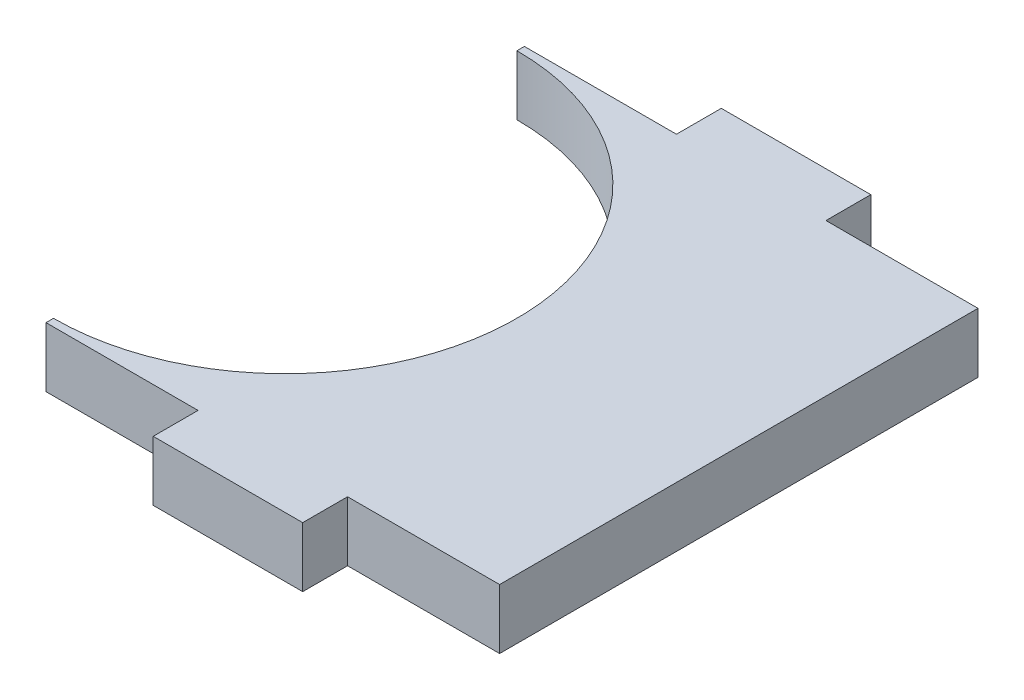
ISO-10303-21;
HEADER;
FILE_DESCRIPTION(('STEP AP214'),'2;1');
FILE_NAME('part.step','',(''),(''),'','','');
FILE_SCHEMA(('AUTOMOTIVE_DESIGN { 1 0 10303 214 1 1 1 1 }'));
ENDSEC;
DATA;
#1=APPLICATION_CONTEXT('core data for automotive mechanical design processes');
#2=APPLICATION_PROTOCOL_DEFINITION('international standard','automotive_design',2000,#1);
#3=PRODUCT_CONTEXT('',#1,'mechanical');
#4=PRODUCT('Part','Part','',(#3));
#5=PRODUCT_RELATED_PRODUCT_CATEGORY('part','',(#4));
#6=PRODUCT_DEFINITION_FORMATION('','',#4);
#7=PRODUCT_DEFINITION_CONTEXT('part definition',#1,'design');
#8=PRODUCT_DEFINITION('design','',#6,#7);
#9=PRODUCT_DEFINITION_SHAPE('','',#8);
#10=(LENGTH_UNIT() NAMED_UNIT(*) SI_UNIT(.MILLI.,.METRE.));
#11=(NAMED_UNIT(*) PLANE_ANGLE_UNIT() SI_UNIT($,.RADIAN.));
#12=(NAMED_UNIT(*) SI_UNIT($,.STERADIAN.) SOLID_ANGLE_UNIT());
#13=UNCERTAINTY_MEASURE_WITH_UNIT(LENGTH_MEASURE(1.E-05),#10,'distance_accuracy_value','');
#14=(GEOMETRIC_REPRESENTATION_CONTEXT(3) GLOBAL_UNCERTAINTY_ASSIGNED_CONTEXT((#13)) GLOBAL_UNIT_ASSIGNED_CONTEXT((#10,
#11,#12)) REPRESENTATION_CONTEXT('',''));
#15=CARTESIAN_POINT('',(0.,0.,0.));
#16=DIRECTION('',(0.,0.,1.));
#17=DIRECTION('',(1.,0.,0.));
#18=AXIS2_PLACEMENT_3D('',#15,#16,#17);
#19=CARTESIAN_POINT('',(59.828997207122,0.499999999999999,36.));
#20=DIRECTION('',(0.,0.,1.));
#21=DIRECTION('',(1.,0.,0.));
#22=AXIS2_PLACEMENT_3D('',#19,#20,#21);
#23=PLANE('',#22);
#24=DIRECTION('',(1.,0.,0.));
#25=VECTOR('',#24,1.);
#26=CARTESIAN_POINT('',(59.828997207122,4.5,36.));
#27=LINE('',#26,#25);
#28=CARTESIAN_POINT('',(59.828997207122,4.5,36.));
#29=VERTEX_POINT('',#28);
#30=CARTESIAN_POINT('',(70.,4.5,36.));
#31=VERTEX_POINT('',#30);
#32=EDGE_CURVE('E185',#29,#31,#27,.T.);
#33=ORIENTED_EDGE('',*,*,#32,.F.);
#34=DIRECTION('',(0.,1.,0.));
#35=VECTOR('',#34,1.);
#36=CARTESIAN_POINT('',(59.828997207122,0.499999999999999,36.));
#37=LINE('',#36,#35);
#38=CARTESIAN_POINT('',(59.828997207122,0.499999999999999,36.));
#39=VERTEX_POINT('',#38);
#40=EDGE_CURVE('E12',#39,#29,#37,.T.);
#41=ORIENTED_EDGE('',*,*,#40,.F.);
#42=DIRECTION('',(1.,0.,0.));
#43=VECTOR('',#42,1.);
#44=CARTESIAN_POINT('',(59.828997207122,0.499999999999999,36.));
#45=LINE('',#44,#43);
#46=CARTESIAN_POINT('',(70.,0.499999999999999,36.));
#47=VERTEX_POINT('',#46);
#48=EDGE_CURVE('E256',#39,#47,#45,.T.);
#49=ORIENTED_EDGE('',*,*,#48,.T.);
#50=DIRECTION('',(0.,1.,0.));
#51=VECTOR('',#50,1.);
#52=CARTESIAN_POINT('',(70.,0.499999999999999,36.));
#53=LINE('',#52,#51);
#54=EDGE_CURVE('E48',#47,#31,#53,.T.);
#55=ORIENTED_EDGE('',*,*,#54,.T.);
#56=EDGE_LOOP('',(#33,#41,#49,#55));
#57=FACE_BOUND('',#56,.T.);
#58=ADVANCED_FACE('F45',(#57),#23,.T.);
#59=CARTESIAN_POINT('',(59.828997207122,0.499999999999999,39.));
#60=DIRECTION('',(1.,0.,0.));
#61=DIRECTION('',(0.,0.,-1.));
#62=AXIS2_PLACEMENT_3D('',#59,#60,#61);
#63=PLANE('',#62);
#64=DIRECTION('',(0.,0.,-1.));
#65=VECTOR('',#64,1.);
#66=CARTESIAN_POINT('',(59.828997207122,4.5,39.));
#67=LINE('',#66,#65);
#68=CARTESIAN_POINT('',(59.828997207122,4.5,39.));
#69=VERTEX_POINT('',#68);
#70=EDGE_CURVE('E252',#69,#29,#67,.T.);
#71=ORIENTED_EDGE('',*,*,#70,.F.);
#72=DIRECTION('',(0.,1.,0.));
#73=VECTOR('',#72,1.);
#74=CARTESIAN_POINT('',(59.828997207122,0.499999999999999,39.));
#75=LINE('',#74,#73);
#76=CARTESIAN_POINT('',(59.828997207122,0.499999999999999,39.));
#77=VERTEX_POINT('',#76);
#78=EDGE_CURVE('E55',#77,#69,#75,.T.);
#79=ORIENTED_EDGE('',*,*,#78,.F.);
#80=DIRECTION('',(0.,0.,-1.));
#81=VECTOR('',#80,1.);
#82=CARTESIAN_POINT('',(59.828997207122,0.499999999999999,39.));
#83=LINE('',#82,#81);
#84=EDGE_CURVE('E170',#77,#39,#83,.T.);
#85=ORIENTED_EDGE('',*,*,#84,.T.);
#86=ORIENTED_EDGE('',*,*,#40,.T.);
#87=EDGE_LOOP('',(#71,#79,#85,#86));
#88=FACE_BOUND('',#87,.T.);
#89=ADVANCED_FACE('F296',(#88),#63,.T.);
#90=CARTESIAN_POINT('',(49.828997207122,0.499999999999999,39.));
#91=DIRECTION('',(0.,0.,1.));
#92=DIRECTION('',(1.,0.,0.));
#93=AXIS2_PLACEMENT_3D('',#90,#91,#92);
#94=PLANE('',#93);
#95=DIRECTION('',(1.,0.,0.));
#96=VECTOR('',#95,1.);
#97=CARTESIAN_POINT('',(49.828997207122,4.5,39.));
#98=LINE('',#97,#96);
#99=CARTESIAN_POINT('',(49.828997207122,4.5,39.));
#100=VERTEX_POINT('',#99);
#101=EDGE_CURVE('E156',#100,#69,#98,.T.);
#102=ORIENTED_EDGE('',*,*,#101,.F.);
#103=DIRECTION('',(0.,1.,0.));
#104=VECTOR('',#103,1.);
#105=CARTESIAN_POINT('',(49.828997207122,0.499999999999999,39.));
#106=LINE('',#105,#104);
#107=CARTESIAN_POINT('',(49.828997207122,0.499999999999999,39.));
#108=VERTEX_POINT('',#107);
#109=EDGE_CURVE('E151',#108,#100,#106,.T.);
#110=ORIENTED_EDGE('',*,*,#109,.F.);
#111=DIRECTION('',(1.,0.,0.));
#112=VECTOR('',#111,1.);
#113=CARTESIAN_POINT('',(49.828997207122,0.499999999999999,39.));
#114=LINE('',#113,#112);
#115=EDGE_CURVE('E154',#108,#77,#114,.T.);
#116=ORIENTED_EDGE('',*,*,#115,.T.);
#117=ORIENTED_EDGE('',*,*,#78,.T.);
#118=EDGE_LOOP('',(#102,#110,#116,#117));
#119=FACE_BOUND('',#118,.T.);
#120=ADVANCED_FACE('F153',(#119),#94,.T.);
#121=CARTESIAN_POINT('',(49.828997207122,0.499999999999999,36.));
#122=DIRECTION('',(-1.,0.,0.));
#123=DIRECTION('',(0.,0.,1.));
#124=AXIS2_PLACEMENT_3D('',#121,#122,#123);
#125=PLANE('',#124);
#126=DIRECTION('',(0.,0.,1.));
#127=VECTOR('',#126,1.);
#128=CARTESIAN_POINT('',(49.828997207122,4.5,36.));
#129=LINE('',#128,#127);
#130=CARTESIAN_POINT('',(49.828997207122,4.5,36.));
#131=VERTEX_POINT('',#130);
#132=EDGE_CURVE('E246',#131,#100,#129,.T.);
#133=ORIENTED_EDGE('',*,*,#132,.F.);
#134=DIRECTION('',(0.,1.,0.));
#135=VECTOR('',#134,1.);
#136=CARTESIAN_POINT('',(49.828997207122,0.499999999999999,36.));
#137=LINE('',#136,#135);
#138=CARTESIAN_POINT('',(49.828997207122,0.499999999999999,36.));
#139=VERTEX_POINT('',#138);
#140=EDGE_CURVE('E162',#139,#131,#137,.T.);
#141=ORIENTED_EDGE('',*,*,#140,.F.);
#142=DIRECTION('',(0.,0.,1.));
#143=VECTOR('',#142,1.);
#144=CARTESIAN_POINT('',(49.828997207122,0.499999999999999,36.));
#145=LINE('',#144,#143);
#146=EDGE_CURVE('E168',#139,#108,#145,.T.);
#147=ORIENTED_EDGE('',*,*,#146,.T.);
#148=ORIENTED_EDGE('',*,*,#109,.T.);
#149=EDGE_LOOP('',(#133,#141,#147,#148));
#150=FACE_BOUND('',#149,.T.);
#151=ADVANCED_FACE('F173',(#150),#125,.T.);
#152=CARTESIAN_POINT('',(39.657994414244,0.499999999999999,36.));
#153=DIRECTION('',(0.,0.,1.));
#154=DIRECTION('',(1.,0.,0.));
#155=AXIS2_PLACEMENT_3D('',#152,#153,#154);
#156=PLANE('',#155);
#157=DIRECTION('',(1.,0.,0.));
#158=VECTOR('',#157,1.);
#159=CARTESIAN_POINT('',(39.657994414244,4.5,36.));
#160=LINE('',#159,#158);
#161=CARTESIAN_POINT('',(39.657994414244,4.5,36.));
#162=VERTEX_POINT('',#161);
#163=EDGE_CURVE('E242',#162,#131,#160,.T.);
#164=ORIENTED_EDGE('',*,*,#163,.F.);
#165=DIRECTION('',(0.,1.,0.));
#166=VECTOR('',#165,1.);
#167=CARTESIAN_POINT('',(39.657994414244,0.499999999999999,36.));
#168=LINE('',#167,#166);
#169=CARTESIAN_POINT('',(39.657994414244,0.499999999999999,36.));
#170=VERTEX_POINT('',#169);
#171=EDGE_CURVE('E262',#170,#162,#168,.T.);
#172=ORIENTED_EDGE('',*,*,#171,.F.);
#173=DIRECTION('',(1.,0.,0.));
#174=VECTOR('',#173,1.);
#175=CARTESIAN_POINT('',(39.657994414244,0.499999999999999,36.));
#176=LINE('',#175,#174);
#177=EDGE_CURVE('E175',#170,#139,#176,.T.);
#178=ORIENTED_EDGE('',*,*,#177,.T.);
#179=ORIENTED_EDGE('',*,*,#140,.T.);
#180=EDGE_LOOP('',(#164,#172,#178,#179));
#181=FACE_BOUND('',#180,.T.);
#182=ADVANCED_FACE('F309',(#181),#156,.T.);
#183=CARTESIAN_POINT('',(39.657994414244,0.499999999999999,36.));
#184=DIRECTION('',(-1.,0.,0.));
#185=DIRECTION('',(0.,0.,1.));
#186=AXIS2_PLACEMENT_3D('',#183,#184,#185);
#187=PLANE('',#186);
#188=DIRECTION('',(0.,0.,1.));
#189=VECTOR('',#188,1.);
#190=CARTESIAN_POINT('',(39.657994414244,4.5,36.));
#191=LINE('',#190,#189);
#192=CARTESIAN_POINT('',(39.657994414244,4.5,35.5));
#193=VERTEX_POINT('',#192);
#194=EDGE_CURVE('E235',#193,#162,#191,.T.);
#195=ORIENTED_EDGE('',*,*,#194,.F.);
#196=DIRECTION('',(0.,1.,0.));
#197=VECTOR('',#196,1.);
#198=CARTESIAN_POINT('',(39.657994414244,0.499999999999999,35.5));
#199=LINE('',#198,#197);
#200=CARTESIAN_POINT('',(39.657994414244,0.499999999999999,35.5));
#201=VERTEX_POINT('',#200);
#202=EDGE_CURVE('E265',#201,#193,#199,.T.);
#203=ORIENTED_EDGE('',*,*,#202,.F.);
#204=DIRECTION('',(0.,0.,1.));
#205=VECTOR('',#204,1.);
#206=CARTESIAN_POINT('',(39.657994414244,0.499999999999999,36.));
#207=LINE('',#206,#205);
#208=EDGE_CURVE('E179',#201,#170,#207,.T.);
#209=ORIENTED_EDGE('',*,*,#208,.T.);
#210=ORIENTED_EDGE('',*,*,#171,.T.);
#211=EDGE_LOOP('',(#195,#203,#209,#210));
#212=FACE_BOUND('',#211,.T.);
#213=ADVANCED_FACE('F312',(#212),#187,.T.);
#214=CARTESIAN_POINT('',(39.657994414244,0.499999999999999,20.));
#215=DIRECTION('',(0.,1.,0.));
#216=DIRECTION('',(0.,0.,1.));
#217=AXIS2_PLACEMENT_3D('',#214,#215,#216);
#218=CYLINDRICAL_SURFACE('',#217,15.5);
#219=CARTESIAN_POINT('',(39.657994414244,4.5,20.));
#220=DIRECTION('',(0.,-1.,0.));
#221=DIRECTION('',(0.,0.,-1.));
#222=AXIS2_PLACEMENT_3D('',#219,#220,#221);
#223=CIRCLE('',#222,15.5);
#224=CARTESIAN_POINT('',(39.657994414244,4.5,4.50000000000001));
#225=VERTEX_POINT('',#224);
#226=EDGE_CURVE('E230',#225,#193,#223,.T.);
#227=ORIENTED_EDGE('',*,*,#226,.F.);
#228=DIRECTION('',(0.,1.,0.));
#229=VECTOR('',#228,1.);
#230=CARTESIAN_POINT('',(39.657994414244,0.499999999999999,4.50000000000001));
#231=LINE('',#230,#229);
#232=CARTESIAN_POINT('',(39.657994414244,0.499999999999999,4.50000000000001));
#233=VERTEX_POINT('',#232);
#234=EDGE_CURVE('E268',#233,#225,#231,.T.);
#235=ORIENTED_EDGE('',*,*,#234,.F.);
#236=CARTESIAN_POINT('',(39.657994414244,0.499999999999999,20.));
#237=DIRECTION('',(0.,-1.,0.));
#238=DIRECTION('',(0.,0.,-1.));
#239=AXIS2_PLACEMENT_3D('',#236,#237,#238);
#240=CIRCLE('',#239,15.5);
#241=EDGE_CURVE('E557',#233,#201,#240,.T.);
#242=ORIENTED_EDGE('',*,*,#241,.T.);
#243=ORIENTED_EDGE('',*,*,#202,.T.);
#244=EDGE_LOOP('',(#227,#235,#242,#243));
#245=FACE_BOUND('',#244,.T.);
#246=ADVANCED_FACE('F316',(#245),#218,.F.);
#247=CARTESIAN_POINT('',(39.657994414244,0.499999999999999,4.));
#248=DIRECTION('',(-1.,0.,0.));
#249=DIRECTION('',(0.,0.,1.));
#250=AXIS2_PLACEMENT_3D('',#247,#248,#249);
#251=PLANE('',#250);
#252=DIRECTION('',(0.,0.,1.));
#253=VECTOR('',#252,1.);
#254=CARTESIAN_POINT('',(39.657994414244,4.5,4.));
#255=LINE('',#254,#253);
#256=CARTESIAN_POINT('',(39.657994414244,4.5,4.));
#257=VERTEX_POINT('',#256);
#258=EDGE_CURVE('E225',#257,#225,#255,.T.);
#259=ORIENTED_EDGE('',*,*,#258,.F.);
#260=DIRECTION('',(0.,1.,0.));
#261=VECTOR('',#260,1.);
#262=CARTESIAN_POINT('',(39.657994414244,0.499999999999999,4.));
#263=LINE('',#262,#261);
#264=CARTESIAN_POINT('',(39.657994414244,0.499999999999999,4.));
#265=VERTEX_POINT('',#264);
#266=EDGE_CURVE('E271',#265,#257,#263,.T.);
#267=ORIENTED_EDGE('',*,*,#266,.F.);
#268=DIRECTION('',(0.,0.,1.));
#269=VECTOR('',#268,1.);
#270=CARTESIAN_POINT('',(39.657994414244,0.499999999999999,4.));
#271=LINE('',#270,#269);
#272=EDGE_CURVE('E552',#265,#233,#271,.T.);
#273=ORIENTED_EDGE('',*,*,#272,.T.);
#274=ORIENTED_EDGE('',*,*,#234,.T.);
#275=EDGE_LOOP('',(#259,#267,#273,#274));
#276=FACE_BOUND('',#275,.T.);
#277=ADVANCED_FACE('F320',(#276),#251,.T.);
#278=CARTESIAN_POINT('',(39.657994414244,0.499999999999999,4.));
#279=DIRECTION('',(0.,0.,-1.));
#280=DIRECTION('',(-1.,0.,0.));
#281=AXIS2_PLACEMENT_3D('',#278,#279,#280);
#282=PLANE('',#281);
#283=DIRECTION('',(-1.,0.,0.));
#284=VECTOR('',#283,1.);
#285=CARTESIAN_POINT('',(39.657994414244,4.5,4.));
#286=LINE('',#285,#284);
#287=CARTESIAN_POINT('',(49.828997207122,4.5,4.00000000000002));
#288=VERTEX_POINT('',#287);
#289=EDGE_CURVE('E221',#288,#257,#286,.T.);
#290=ORIENTED_EDGE('',*,*,#289,.F.);
#291=DIRECTION('',(0.,1.,0.));
#292=VECTOR('',#291,1.);
#293=CARTESIAN_POINT('',(49.828997207122,0.499999999999999,4.00000000000002));
#294=LINE('',#293,#292);
#295=CARTESIAN_POINT('',(49.828997207122,0.499999999999999,4.00000000000002));
#296=VERTEX_POINT('',#295);
#297=EDGE_CURVE('E274',#296,#288,#294,.T.);
#298=ORIENTED_EDGE('',*,*,#297,.F.);
#299=DIRECTION('',(-1.,0.,0.));
#300=VECTOR('',#299,1.);
#301=CARTESIAN_POINT('',(39.657994414244,0.499999999999999,4.));
#302=LINE('',#301,#300);
#303=EDGE_CURVE('E547',#296,#265,#302,.T.);
#304=ORIENTED_EDGE('',*,*,#303,.T.);
#305=ORIENTED_EDGE('',*,*,#266,.T.);
#306=EDGE_LOOP('',(#290,#298,#304,#305));
#307=FACE_BOUND('',#306,.T.);
#308=ADVANCED_FACE('F324',(#307),#282,.T.);
#309=CARTESIAN_POINT('',(49.828997207122,0.499999999999999,4.00000000000002));
#310=DIRECTION('',(-1.,0.,0.));
#311=DIRECTION('',(0.,0.,1.));
#312=AXIS2_PLACEMENT_3D('',#309,#310,#311);
#313=PLANE('',#312);
#314=DIRECTION('',(0.,0.,1.));
#315=VECTOR('',#314,1.);
#316=CARTESIAN_POINT('',(49.828997207122,4.5,4.00000000000002));
#317=LINE('',#316,#315);
#318=CARTESIAN_POINT('',(49.828997207122,4.5,1.00000000000001));
#319=VERTEX_POINT('',#318);
#320=EDGE_CURVE('E213',#319,#288,#317,.T.);
#321=ORIENTED_EDGE('',*,*,#320,.F.);
#322=DIRECTION('',(0.,1.,0.));
#323=VECTOR('',#322,1.);
#324=CARTESIAN_POINT('',(49.828997207122,0.499999999999999,1.00000000000001));
#325=LINE('',#324,#323);
#326=CARTESIAN_POINT('',(49.828997207122,0.499999999999999,1.00000000000001));
#327=VERTEX_POINT('',#326);
#328=EDGE_CURVE('E277',#327,#319,#325,.T.);
#329=ORIENTED_EDGE('',*,*,#328,.F.);
#330=DIRECTION('',(0.,0.,1.));
#331=VECTOR('',#330,1.);
#332=CARTESIAN_POINT('',(49.828997207122,0.499999999999999,4.00000000000002));
#333=LINE('',#332,#331);
#334=EDGE_CURVE('E543',#327,#296,#333,.T.);
#335=ORIENTED_EDGE('',*,*,#334,.T.);
#336=ORIENTED_EDGE('',*,*,#297,.T.);
#337=EDGE_LOOP('',(#321,#329,#335,#336));
#338=FACE_BOUND('',#337,.T.);
#339=ADVANCED_FACE('F328',(#338),#313,.T.);
#340=CARTESIAN_POINT('',(49.828997207122,0.499999999999999,1.00000000000001));
#341=DIRECTION('',(0.,0.,-1.));
#342=DIRECTION('',(-1.,0.,0.));
#343=AXIS2_PLACEMENT_3D('',#340,#341,#342);
#344=PLANE('',#343);
#345=DIRECTION('',(-1.,0.,0.));
#346=VECTOR('',#345,1.);
#347=CARTESIAN_POINT('',(49.828997207122,4.5,1.00000000000001));
#348=LINE('',#347,#346);
#349=CARTESIAN_POINT('',(59.828997207122,4.5,1.00000000000001));
#350=VERTEX_POINT('',#349);
#351=EDGE_CURVE('E208',#350,#319,#348,.T.);
#352=ORIENTED_EDGE('',*,*,#351,.F.);
#353=DIRECTION('',(0.,1.,0.));
#354=VECTOR('',#353,1.);
#355=CARTESIAN_POINT('',(59.828997207122,0.499999999999999,1.00000000000001));
#356=LINE('',#355,#354);
#357=CARTESIAN_POINT('',(59.828997207122,0.499999999999999,1.00000000000001));
#358=VERTEX_POINT('',#357);
#359=EDGE_CURVE('E280',#358,#350,#356,.T.);
#360=ORIENTED_EDGE('',*,*,#359,.F.);
#361=DIRECTION('',(-1.,0.,0.));
#362=VECTOR('',#361,1.);
#363=CARTESIAN_POINT('',(49.828997207122,0.499999999999999,1.00000000000001));
#364=LINE('',#363,#362);
#365=EDGE_CURVE('E516',#358,#327,#364,.T.);
#366=ORIENTED_EDGE('',*,*,#365,.T.);
#367=ORIENTED_EDGE('',*,*,#328,.T.);
#368=EDGE_LOOP('',(#352,#360,#366,#367));
#369=FACE_BOUND('',#368,.T.);
#370=ADVANCED_FACE('F332',(#369),#344,.T.);
#371=CARTESIAN_POINT('',(59.828997207122,0.499999999999999,1.00000000000001));
#372=DIRECTION('',(1.,0.,0.));
#373=DIRECTION('',(0.,0.,-1.));
#374=AXIS2_PLACEMENT_3D('',#371,#372,#373);
#375=PLANE('',#374);
#376=DIRECTION('',(0.,0.,-1.));
#377=VECTOR('',#376,1.);
#378=CARTESIAN_POINT('',(59.828997207122,4.5,1.00000000000001));
#379=LINE('',#378,#377);
#380=CARTESIAN_POINT('',(59.828997207122,4.5,4.00000000000002));
#381=VERTEX_POINT('',#380);
#382=EDGE_CURVE('E203',#381,#350,#379,.T.);
#383=ORIENTED_EDGE('',*,*,#382,.F.);
#384=DIRECTION('',(0.,1.,0.));
#385=VECTOR('',#384,1.);
#386=CARTESIAN_POINT('',(59.828997207122,0.499999999999999,4.00000000000002));
#387=LINE('',#386,#385);
#388=CARTESIAN_POINT('',(59.828997207122,0.499999999999999,4.00000000000002));
#389=VERTEX_POINT('',#388);
#390=EDGE_CURVE('E283',#389,#381,#387,.T.);
#391=ORIENTED_EDGE('',*,*,#390,.F.);
#392=DIRECTION('',(0.,0.,-1.));
#393=VECTOR('',#392,1.);
#394=CARTESIAN_POINT('',(59.828997207122,0.499999999999999,1.00000000000001));
#395=LINE('',#394,#393);
#396=EDGE_CURVE('E512',#389,#358,#395,.T.);
#397=ORIENTED_EDGE('',*,*,#396,.T.);
#398=ORIENTED_EDGE('',*,*,#359,.T.);
#399=EDGE_LOOP('',(#383,#391,#397,#398));
#400=FACE_BOUND('',#399,.T.);
#401=ADVANCED_FACE('F336',(#400),#375,.T.);
#402=CARTESIAN_POINT('',(59.828997207122,0.499999999999999,4.00000000000002));
#403=DIRECTION('',(0.,0.,-1.));
#404=DIRECTION('',(-1.,0.,0.));
#405=AXIS2_PLACEMENT_3D('',#402,#403,#404);
#406=PLANE('',#405);
#407=DIRECTION('',(-1.,0.,0.));
#408=VECTOR('',#407,1.);
#409=CARTESIAN_POINT('',(59.828997207122,4.5,4.00000000000002));
#410=LINE('',#409,#408);
#411=CARTESIAN_POINT('',(70.,4.5,4.));
#412=VERTEX_POINT('',#411);
#413=EDGE_CURVE('E199',#412,#381,#410,.T.);
#414=ORIENTED_EDGE('',*,*,#413,.F.);
#415=DIRECTION('',(0.,1.,0.));
#416=VECTOR('',#415,1.);
#417=CARTESIAN_POINT('',(70.,0.499999999999999,4.));
#418=LINE('',#417,#416);
#419=CARTESIAN_POINT('',(70.,0.499999999999999,4.));
#420=VERTEX_POINT('',#419);
#421=EDGE_CURVE('E285',#420,#412,#418,.T.);
#422=ORIENTED_EDGE('',*,*,#421,.F.);
#423=DIRECTION('',(-1.,0.,0.));
#424=VECTOR('',#423,1.);
#425=CARTESIAN_POINT('',(59.828997207122,0.499999999999999,4.00000000000002));
#426=LINE('',#425,#424);
#427=EDGE_CURVE('E533',#420,#389,#426,.T.);
#428=ORIENTED_EDGE('',*,*,#427,.T.);
#429=ORIENTED_EDGE('',*,*,#390,.T.);
#430=EDGE_LOOP('',(#414,#422,#428,#429));
#431=FACE_BOUND('',#430,.T.);
#432=ADVANCED_FACE('F340',(#431),#406,.T.);
#433=CARTESIAN_POINT('',(70.,0.499999999999999,36.));
#434=DIRECTION('',(1.,0.,0.));
#435=DIRECTION('',(0.,0.,-1.));
#436=AXIS2_PLACEMENT_3D('',#433,#434,#435);
#437=PLANE('',#436);
#438=DIRECTION('',(0.,0.,-1.));
#439=VECTOR('',#438,1.);
#440=CARTESIAN_POINT('',(70.,4.5,36.));
#441=LINE('',#440,#439);
#442=EDGE_CURVE('E190',#31,#412,#441,.T.);
#443=ORIENTED_EDGE('',*,*,#442,.F.);
#444=ORIENTED_EDGE('',*,*,#54,.F.);
#445=DIRECTION('',(0.,0.,-1.));
#446=VECTOR('',#445,1.);
#447=CARTESIAN_POINT('',(70.,0.499999999999999,36.));
#448=LINE('',#447,#446);
#449=EDGE_CURVE('E529',#47,#420,#448,.T.);
#450=ORIENTED_EDGE('',*,*,#449,.T.);
#451=ORIENTED_EDGE('',*,*,#421,.T.);
#452=EDGE_LOOP('',(#443,#444,#450,#451));
#453=FACE_BOUND('',#452,.T.);
#454=ADVANCED_FACE('F293',(#453),#437,.T.);
#455=CARTESIAN_POINT('',(39.657994414244,0.499999999999999,20.));
#456=DIRECTION('',(0.,-1.,0.));
#457=DIRECTION('',(0.,0.,-1.));
#458=AXIS2_PLACEMENT_3D('',#455,#456,#457);
#459=PLANE('',#458);
#460=ORIENTED_EDGE('',*,*,#48,.F.);
#461=ORIENTED_EDGE('',*,*,#84,.F.);
#462=ORIENTED_EDGE('',*,*,#115,.F.);
#463=ORIENTED_EDGE('',*,*,#146,.F.);
#464=ORIENTED_EDGE('',*,*,#177,.F.);
#465=ORIENTED_EDGE('',*,*,#208,.F.);
#466=ORIENTED_EDGE('',*,*,#241,.F.);
#467=ORIENTED_EDGE('',*,*,#272,.F.);
#468=ORIENTED_EDGE('',*,*,#303,.F.);
#469=ORIENTED_EDGE('',*,*,#334,.F.);
#470=ORIENTED_EDGE('',*,*,#365,.F.);
#471=ORIENTED_EDGE('',*,*,#396,.F.);
#472=ORIENTED_EDGE('',*,*,#427,.F.);
#473=ORIENTED_EDGE('',*,*,#449,.F.);
#474=EDGE_LOOP('',(#460,#461,#462,#463,#464,#465,#466,#467,#468,#469,#470,#471,#472,#473));
#475=FACE_BOUND('',#474,.T.);
#476=ADVANCED_FACE('F166',(#475),#459,.T.);
#477=CARTESIAN_POINT('',(39.657994414244,4.5,20.));
#478=DIRECTION('',(0.,-1.,0.));
#479=DIRECTION('',(0.,0.,-1.));
#480=AXIS2_PLACEMENT_3D('',#477,#478,#479);
#481=PLANE('',#480);
#482=ORIENTED_EDGE('',*,*,#32,.T.);
#483=ORIENTED_EDGE('',*,*,#442,.T.);
#484=ORIENTED_EDGE('',*,*,#413,.T.);
#485=ORIENTED_EDGE('',*,*,#382,.T.);
#486=ORIENTED_EDGE('',*,*,#351,.T.);
#487=ORIENTED_EDGE('',*,*,#320,.T.);
#488=ORIENTED_EDGE('',*,*,#289,.T.);
#489=ORIENTED_EDGE('',*,*,#258,.T.);
#490=ORIENTED_EDGE('',*,*,#226,.T.);
#491=ORIENTED_EDGE('',*,*,#194,.T.);
#492=ORIENTED_EDGE('',*,*,#163,.T.);
#493=ORIENTED_EDGE('',*,*,#132,.T.);
#494=ORIENTED_EDGE('',*,*,#101,.T.);
#495=ORIENTED_EDGE('',*,*,#70,.T.);
#496=EDGE_LOOP('',(#482,#483,#484,#485,#486,#487,#488,#489,#490,#491,#492,#493,#494,#495));
#497=FACE_BOUND('',#496,.T.);
#498=ADVANCED_FACE('F295',(#497),#481,.F.);
#499=CLOSED_SHELL('',(#58,#89,#120,#151,#182,#213,#246,#277,#308,#339,#370,#401,#432,#454,#476,#498));
#500=MANIFOLD_SOLID_BREP('B2',#499);
#501=ADVANCED_BREP_SHAPE_REPRESENTATION('',(#18,#500),#14);
#502=SHAPE_DEFINITION_REPRESENTATION(#9,#501);
ENDSEC;
END-ISO-10303-21;
